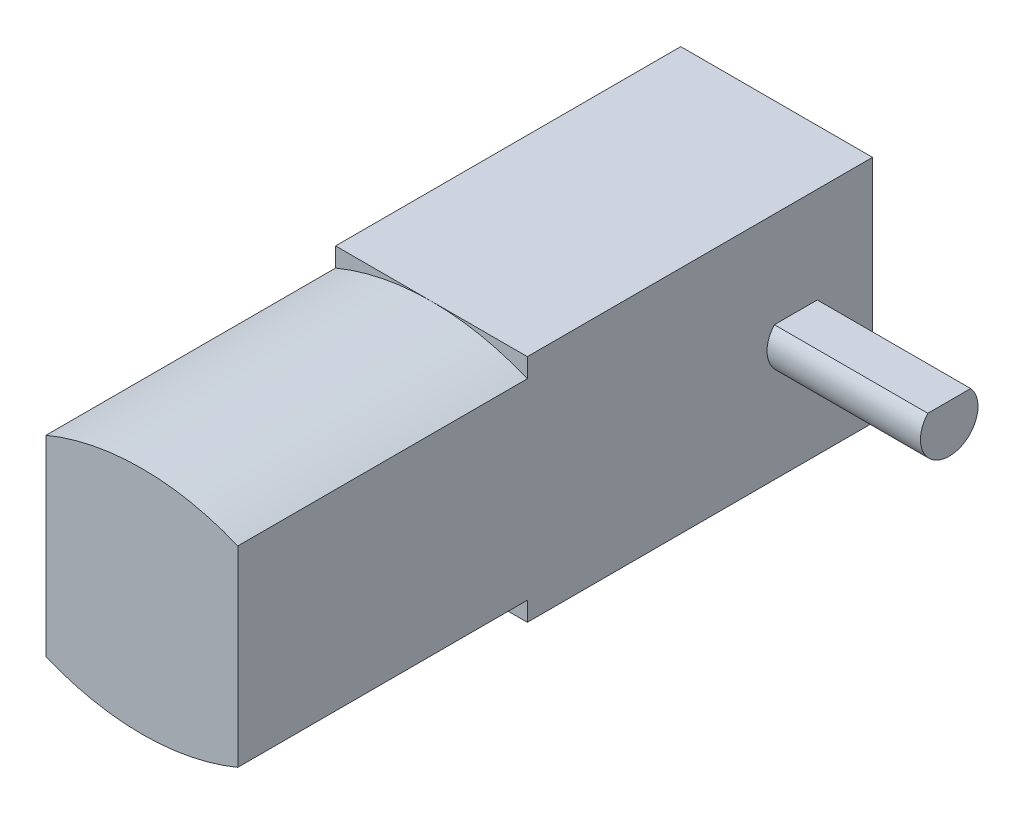
ISO-10303-21;
HEADER;
FILE_DESCRIPTION(('STEP AP214'),'2;1');
FILE_NAME('part.step','',(''),(''),'','','');
FILE_SCHEMA(('AUTOMOTIVE_DESIGN { 1 0 10303 214 1 1 1 1 }'));
ENDSEC;
DATA;
#1=APPLICATION_CONTEXT('core data for automotive mechanical design processes');
#2=APPLICATION_PROTOCOL_DEFINITION('international standard','automotive_design',2000,#1);
#3=PRODUCT_CONTEXT('',#1,'mechanical');
#4=PRODUCT('Part','Part','',(#3));
#5=PRODUCT_RELATED_PRODUCT_CATEGORY('part','',(#4));
#6=PRODUCT_DEFINITION_FORMATION('','',#4);
#7=PRODUCT_DEFINITION_CONTEXT('part definition',#1,'design');
#8=PRODUCT_DEFINITION('design','',#6,#7);
#9=PRODUCT_DEFINITION_SHAPE('','',#8);
#10=(LENGTH_UNIT() NAMED_UNIT(*) SI_UNIT(.MILLI.,.METRE.));
#11=(NAMED_UNIT(*) PLANE_ANGLE_UNIT() SI_UNIT($,.RADIAN.));
#12=(NAMED_UNIT(*) SI_UNIT($,.STERADIAN.) SOLID_ANGLE_UNIT());
#13=UNCERTAINTY_MEASURE_WITH_UNIT(LENGTH_MEASURE(1.E-05),#10,'distance_accuracy_value','');
#14=(GEOMETRIC_REPRESENTATION_CONTEXT(3) GLOBAL_UNCERTAINTY_ASSIGNED_CONTEXT((#13)) GLOBAL_UNIT_ASSIGNED_CONTEXT((#10,
#11,#12)) REPRESENTATION_CONTEXT('',''));
#15=CARTESIAN_POINT('',(0.,0.,0.));
#16=DIRECTION('',(0.,0.,1.));
#17=DIRECTION('',(1.,0.,0.));
#18=AXIS2_PLACEMENT_3D('',#15,#16,#17);
#19=CARTESIAN_POINT('',(5.,0.,15.1));
#20=DIRECTION('',(-1.,0.,0.));
#21=DIRECTION('',(0.,0.,1.));
#22=AXIS2_PLACEMENT_3D('',#19,#20,#21);
#23=PLANE('',#22);
#24=DIRECTION('',(0.,0.,1.));
#25=VECTOR('',#24,1.);
#26=CARTESIAN_POINT('',(5.,1.,0.));
#27=LINE('',#26,#25);
#28=CARTESIAN_POINT('',(5.,1.,-15.1180339887499));
#29=VERTEX_POINT('',#28);
#30=CARTESIAN_POINT('',(5.,1.,-12.8819660112501));
#31=VERTEX_POINT('',#30);
#32=EDGE_CURVE('E193',#29,#31,#27,.T.);
#33=ORIENTED_EDGE('',*,*,#32,.F.);
#34=CARTESIAN_POINT('',(5.,0.,-14.));
#35=DIRECTION('',(1.,0.,0.));
#36=DIRECTION('',(0.,0.,-1.));
#37=AXIS2_PLACEMENT_3D('',#34,#35,#36);
#38=CIRCLE('',#37,1.5);
#39=EDGE_CURVE('E52',#31,#29,#38,.T.);
#40=ORIENTED_EDGE('',*,*,#39,.F.);
#41=EDGE_LOOP('',(#33,#40));
#42=FACE_BOUND('',#41,.T.);
#43=DIRECTION('',(0.,0.,-1.));
#44=VECTOR('',#43,1.);
#45=CARTESIAN_POINT('',(5.,-5.,15.1));
#46=LINE('',#45,#44);
#47=CARTESIAN_POINT('',(5.,-5.,15.1));
#48=VERTEX_POINT('',#47);
#49=CARTESIAN_POINT('',(5.,-5.,0.));
#50=VERTEX_POINT('',#49);
#51=EDGE_CURVE('E61',#48,#50,#46,.T.);
#52=ORIENTED_EDGE('',*,*,#51,.T.);
#53=DIRECTION('',(0.,1.,0.));
#54=VECTOR('',#53,1.);
#55=CARTESIAN_POINT('',(5.,-6.,0.));
#56=LINE('',#55,#54);
#57=CARTESIAN_POINT('',(5.,-6.,0.));
#58=VERTEX_POINT('',#57);
#59=EDGE_CURVE('E142',#58,#50,#56,.T.);
#60=ORIENTED_EDGE('',*,*,#59,.F.);
#61=DIRECTION('',(0.,0.,1.));
#62=VECTOR('',#61,1.);
#63=CARTESIAN_POINT('',(5.,-6.,-18.));
#64=LINE('',#63,#62);
#65=CARTESIAN_POINT('',(5.,-6.,-18.));
#66=VERTEX_POINT('',#65);
#67=EDGE_CURVE('E158',#66,#58,#64,.T.);
#68=ORIENTED_EDGE('',*,*,#67,.F.);
#69=DIRECTION('',(0.,1.,0.));
#70=VECTOR('',#69,1.);
#71=CARTESIAN_POINT('',(5.,-6.,-18.));
#72=LINE('',#71,#70);
#73=CARTESIAN_POINT('',(5.,6.,-18.));
#74=VERTEX_POINT('',#73);
#75=EDGE_CURVE('E177',#66,#74,#72,.T.);
#76=ORIENTED_EDGE('',*,*,#75,.T.);
#77=DIRECTION('',(0.,0.,1.));
#78=VECTOR('',#77,1.);
#79=CARTESIAN_POINT('',(5.,6.,-18.));
#80=LINE('',#79,#78);
#81=CARTESIAN_POINT('',(5.,6.,0.));
#82=VERTEX_POINT('',#81);
#83=EDGE_CURVE('E161',#74,#82,#80,.T.);
#84=ORIENTED_EDGE('',*,*,#83,.T.);
#85=CARTESIAN_POINT('',(5.,5.,0.));
#86=VERTEX_POINT('',#85);
#87=EDGE_CURVE('E151',#86,#82,#56,.T.);
#88=ORIENTED_EDGE('',*,*,#87,.F.);
#89=DIRECTION('',(0.,0.,-1.));
#90=VECTOR('',#89,1.);
#91=CARTESIAN_POINT('',(5.,5.,15.1));
#92=LINE('',#91,#90);
#93=CARTESIAN_POINT('',(5.,5.,15.1));
#94=VERTEX_POINT('',#93);
#95=EDGE_CURVE('E11',#94,#86,#92,.T.);
#96=ORIENTED_EDGE('',*,*,#95,.F.);
#97=DIRECTION('',(0.,1.,0.));
#98=VECTOR('',#97,1.);
#99=CARTESIAN_POINT('',(5.,0.,15.1));
#100=LINE('',#99,#98);
#101=EDGE_CURVE('E97',#48,#94,#100,.T.);
#102=ORIENTED_EDGE('',*,*,#101,.F.);
#103=EDGE_LOOP('',(#52,#60,#68,#76,#84,#88,#96,#102));
#104=FACE_BOUND('',#103,.T.);
#105=ADVANCED_FACE('F39',(#42,#104),#23,.F.);
#106=CARTESIAN_POINT('',(0.,-7.0000000000001,15.1));
#107=DIRECTION('',(0.,0.,-1.));
#108=DIRECTION('',(-1.,0.,0.));
#109=AXIS2_PLACEMENT_3D('',#106,#107,#108);
#110=CYLINDRICAL_SURFACE('',#109,13.0000000000001);
#111=CARTESIAN_POINT('',(0.,-7.0000000000001,0.));
#112=DIRECTION('',(0.,0.,1.));
#113=DIRECTION('',(1.,0.,0.));
#114=AXIS2_PLACEMENT_3D('',#111,#112,#113);
#115=CIRCLE('',#114,13.0000000000001);
#116=CARTESIAN_POINT('',(0.,6.,0.));
#117=VERTEX_POINT('',#116);
#118=EDGE_CURVE('E114',#86,#117,#115,.T.);
#119=ORIENTED_EDGE('',*,*,#118,.T.);
#120=CARTESIAN_POINT('',(-5.,5.,0.));
#121=VERTEX_POINT('',#120);
#122=EDGE_CURVE('E81',#117,#121,#115,.T.);
#123=ORIENTED_EDGE('',*,*,#122,.T.);
#124=DIRECTION('',(0.,0.,-1.));
#125=VECTOR('',#124,1.);
#126=CARTESIAN_POINT('',(-5.,5.,15.1));
#127=LINE('',#126,#125);
#128=CARTESIAN_POINT('',(-5.,5.,15.1));
#129=VERTEX_POINT('',#128);
#130=EDGE_CURVE('E46',#129,#121,#127,.T.);
#131=ORIENTED_EDGE('',*,*,#130,.F.);
#132=CARTESIAN_POINT('',(0.,-7.0000000000001,15.1));
#133=DIRECTION('',(0.,0.,1.));
#134=DIRECTION('',(1.,0.,0.));
#135=AXIS2_PLACEMENT_3D('',#132,#133,#134);
#136=CIRCLE('',#135,13.0000000000001);
#137=EDGE_CURVE('E91',#94,#129,#136,.T.);
#138=ORIENTED_EDGE('',*,*,#137,.F.);
#139=ORIENTED_EDGE('',*,*,#95,.T.);
#140=EDGE_LOOP('',(#119,#123,#131,#138,#139));
#141=FACE_BOUND('',#140,.T.);
#142=ADVANCED_FACE('F103',(#141),#110,.T.);
#143=CARTESIAN_POINT('',(-5.,0.,15.1));
#144=DIRECTION('',(-1.,0.,0.));
#145=DIRECTION('',(0.,0.,1.));
#146=AXIS2_PLACEMENT_3D('',#143,#144,#145);
#147=PLANE('',#146);
#148=ORIENTED_EDGE('',*,*,#130,.T.);
#149=DIRECTION('',(0.,-1.,0.));
#150=VECTOR('',#149,1.);
#151=CARTESIAN_POINT('',(-5.,-6.,0.));
#152=LINE('',#151,#150);
#153=CARTESIAN_POINT('',(-5.,6.,0.));
#154=VERTEX_POINT('',#153);
#155=EDGE_CURVE('E75',#154,#121,#152,.T.);
#156=ORIENTED_EDGE('',*,*,#155,.F.);
#157=DIRECTION('',(0.,0.,1.));
#158=VECTOR('',#157,1.);
#159=CARTESIAN_POINT('',(-5.,6.,-18.));
#160=LINE('',#159,#158);
#161=CARTESIAN_POINT('',(-5.,6.,-18.));
#162=VERTEX_POINT('',#161);
#163=EDGE_CURVE('E164',#162,#154,#160,.T.);
#164=ORIENTED_EDGE('',*,*,#163,.F.);
#165=DIRECTION('',(0.,-1.,0.));
#166=VECTOR('',#165,1.);
#167=CARTESIAN_POINT('',(-5.,-6.,-18.));
#168=LINE('',#167,#166);
#169=CARTESIAN_POINT('',(-5.,-6.,-18.));
#170=VERTEX_POINT('',#169);
#171=EDGE_CURVE('E169',#162,#170,#168,.T.);
#172=ORIENTED_EDGE('',*,*,#171,.T.);
#173=DIRECTION('',(0.,0.,1.));
#174=VECTOR('',#173,1.);
#175=CARTESIAN_POINT('',(-5.,-6.,-18.));
#176=LINE('',#175,#174);
#177=CARTESIAN_POINT('',(-5.,-6.,0.));
#178=VERTEX_POINT('',#177);
#179=EDGE_CURVE('E155',#170,#178,#176,.T.);
#180=ORIENTED_EDGE('',*,*,#179,.T.);
#181=CARTESIAN_POINT('',(-5.,-5.,0.));
#182=VERTEX_POINT('',#181);
#183=EDGE_CURVE('E174',#182,#178,#152,.T.);
#184=ORIENTED_EDGE('',*,*,#183,.F.);
#185=DIRECTION('',(0.,0.,-1.));
#186=VECTOR('',#185,1.);
#187=CARTESIAN_POINT('',(-5.,-5.,15.1));
#188=LINE('',#187,#186);
#189=CARTESIAN_POINT('',(-5.,-5.,15.1));
#190=VERTEX_POINT('',#189);
#191=EDGE_CURVE('E105',#190,#182,#188,.T.);
#192=ORIENTED_EDGE('',*,*,#191,.F.);
#193=DIRECTION('',(0.,1.,0.));
#194=VECTOR('',#193,1.);
#195=CARTESIAN_POINT('',(-5.,0.,15.1));
#196=LINE('',#195,#194);
#197=EDGE_CURVE('E96',#190,#129,#196,.T.);
#198=ORIENTED_EDGE('',*,*,#197,.T.);
#199=EDGE_LOOP('',(#148,#156,#164,#172,#180,#184,#192,#198));
#200=FACE_BOUND('',#199,.T.);
#201=ADVANCED_FACE('F106',(#200),#147,.T.);
#202=CARTESIAN_POINT('',(0.,6.99999999999999,15.1));
#203=DIRECTION('',(0.,0.,-1.));
#204=DIRECTION('',(-1.,0.,0.));
#205=AXIS2_PLACEMENT_3D('',#202,#203,#204);
#206=CYLINDRICAL_SURFACE('',#205,13.);
#207=CARTESIAN_POINT('',(0.,6.99999999999999,0.));
#208=DIRECTION('',(0.,0.,1.));
#209=DIRECTION('',(1.,0.,0.));
#210=AXIS2_PLACEMENT_3D('',#207,#208,#209);
#211=CIRCLE('',#210,13.);
#212=CARTESIAN_POINT('',(0.,-6.,0.));
#213=VERTEX_POINT('',#212);
#214=EDGE_CURVE('E117',#50,#213,#211,.F.);
#215=ORIENTED_EDGE('',*,*,#214,.F.);
#216=ORIENTED_EDGE('',*,*,#51,.F.);
#217=CARTESIAN_POINT('',(0.,6.99999999999999,15.1));
#218=DIRECTION('',(0.,0.,1.));
#219=DIRECTION('',(1.,0.,0.));
#220=AXIS2_PLACEMENT_3D('',#217,#218,#219);
#221=CIRCLE('',#220,13.);
#222=EDGE_CURVE('E109',#48,#190,#221,.F.);
#223=ORIENTED_EDGE('',*,*,#222,.T.);
#224=ORIENTED_EDGE('',*,*,#191,.T.);
#225=EDGE_CURVE('E116',#213,#182,#211,.F.);
#226=ORIENTED_EDGE('',*,*,#225,.F.);
#227=EDGE_LOOP('',(#215,#216,#223,#224,#226));
#228=FACE_BOUND('',#227,.T.);
#229=ADVANCED_FACE('F123',(#228),#206,.T.);
#230=CARTESIAN_POINT('',(0.,0.,15.1));
#231=DIRECTION('',(0.,0.,1.));
#232=DIRECTION('',(1.,0.,0.));
#233=AXIS2_PLACEMENT_3D('',#230,#231,#232);
#234=PLANE('',#233);
#235=ORIENTED_EDGE('',*,*,#101,.T.);
#236=ORIENTED_EDGE('',*,*,#137,.T.);
#237=ORIENTED_EDGE('',*,*,#197,.F.);
#238=ORIENTED_EDGE('',*,*,#222,.F.);
#239=EDGE_LOOP('',(#235,#236,#237,#238));
#240=FACE_BOUND('',#239,.T.);
#241=ADVANCED_FACE('F93',(#240),#234,.T.);
#242=CARTESIAN_POINT('',(0.,0.,0.));
#243=DIRECTION('',(0.,0.,1.));
#244=DIRECTION('',(1.,0.,0.));
#245=AXIS2_PLACEMENT_3D('',#242,#243,#244);
#246=PLANE('',#245);
#247=ORIENTED_EDGE('',*,*,#59,.T.);
#248=ORIENTED_EDGE('',*,*,#214,.T.);
#249=DIRECTION('',(1.,0.,0.));
#250=VECTOR('',#249,1.);
#251=CARTESIAN_POINT('',(5.,-6.,0.));
#252=LINE('',#251,#250);
#253=EDGE_CURVE('E146',#213,#58,#252,.T.);
#254=ORIENTED_EDGE('',*,*,#253,.T.);
#255=EDGE_LOOP('',(#247,#248,#254));
#256=FACE_BOUND('',#255,.T.);
#257=ADVANCED_FACE('F143',(#256),#246,.T.);
#258=ORIENTED_EDGE('',*,*,#118,.F.);
#259=ORIENTED_EDGE('',*,*,#87,.T.);
#260=DIRECTION('',(-1.,0.,0.));
#261=VECTOR('',#260,1.);
#262=CARTESIAN_POINT('',(5.,6.,0.));
#263=LINE('',#262,#261);
#264=EDGE_CURVE('E167',#82,#117,#263,.T.);
#265=ORIENTED_EDGE('',*,*,#264,.T.);
#266=EDGE_LOOP('',(#258,#259,#265));
#267=FACE_BOUND('',#266,.T.);
#268=ADVANCED_FACE('F252',(#267),#246,.T.);
#269=ORIENTED_EDGE('',*,*,#122,.F.);
#270=EDGE_CURVE('E150',#117,#154,#263,.T.);
#271=ORIENTED_EDGE('',*,*,#270,.T.);
#272=ORIENTED_EDGE('',*,*,#155,.T.);
#273=EDGE_LOOP('',(#269,#271,#272));
#274=FACE_BOUND('',#273,.T.);
#275=ADVANCED_FACE('F228',(#274),#246,.T.);
#276=CARTESIAN_POINT('',(5.,6.,-18.));
#277=DIRECTION('',(0.,1.,0.));
#278=DIRECTION('',(-1.,0.,0.));
#279=AXIS2_PLACEMENT_3D('',#276,#277,#278);
#280=PLANE('',#279);
#281=ORIENTED_EDGE('',*,*,#264,.F.);
#282=ORIENTED_EDGE('',*,*,#83,.F.);
#283=DIRECTION('',(-1.,0.,0.));
#284=VECTOR('',#283,1.);
#285=CARTESIAN_POINT('',(5.,6.,-18.));
#286=LINE('',#285,#284);
#287=EDGE_CURVE('E159',#74,#162,#286,.T.);
#288=ORIENTED_EDGE('',*,*,#287,.T.);
#289=ORIENTED_EDGE('',*,*,#163,.T.);
#290=ORIENTED_EDGE('',*,*,#270,.F.);
#291=EDGE_LOOP('',(#281,#282,#288,#289,#290));
#292=FACE_BOUND('',#291,.T.);
#293=ADVANCED_FACE('F231',(#292),#280,.T.);
#294=CARTESIAN_POINT('',(5.,-6.,-18.));
#295=DIRECTION('',(0.,-1.,0.));
#296=DIRECTION('',(1.,0.,0.));
#297=AXIS2_PLACEMENT_3D('',#294,#295,#296);
#298=PLANE('',#297);
#299=EDGE_CURVE('E171',#178,#213,#252,.T.);
#300=ORIENTED_EDGE('',*,*,#299,.F.);
#301=ORIENTED_EDGE('',*,*,#179,.F.);
#302=DIRECTION('',(1.,0.,0.));
#303=VECTOR('',#302,1.);
#304=CARTESIAN_POINT('',(5.,-6.,-18.));
#305=LINE('',#304,#303);
#306=EDGE_CURVE('E180',#170,#66,#305,.T.);
#307=ORIENTED_EDGE('',*,*,#306,.T.);
#308=ORIENTED_EDGE('',*,*,#67,.T.);
#309=ORIENTED_EDGE('',*,*,#253,.F.);
#310=EDGE_LOOP('',(#300,#301,#307,#308,#309));
#311=FACE_BOUND('',#310,.T.);
#312=ADVANCED_FACE('F240',(#311),#298,.T.);
#313=CARTESIAN_POINT('',(0.,0.,-18.));
#314=DIRECTION('',(0.,0.,1.));
#315=DIRECTION('',(1.,0.,0.));
#316=AXIS2_PLACEMENT_3D('',#313,#314,#315);
#317=PLANE('',#316);
#318=ORIENTED_EDGE('',*,*,#171,.F.);
#319=ORIENTED_EDGE('',*,*,#287,.F.);
#320=ORIENTED_EDGE('',*,*,#75,.F.);
#321=ORIENTED_EDGE('',*,*,#306,.F.);
#322=EDGE_LOOP('',(#318,#319,#320,#321));
#323=FACE_BOUND('',#322,.T.);
#324=ADVANCED_FACE('F236',(#323),#317,.F.);
#325=ORIENTED_EDGE('',*,*,#299,.T.);
#326=ORIENTED_EDGE('',*,*,#225,.T.);
#327=ORIENTED_EDGE('',*,*,#183,.T.);
#328=EDGE_LOOP('',(#325,#326,#327));
#329=FACE_BOUND('',#328,.T.);
#330=ADVANCED_FACE('F241',(#329),#246,.T.);
#331=CARTESIAN_POINT('',(13.,1.,0.));
#332=DIRECTION('',(0.,-1.,0.));
#333=DIRECTION('',(0.,0.,-1.));
#334=AXIS2_PLACEMENT_3D('',#331,#332,#333);
#335=PLANE('',#334);
#336=ORIENTED_EDGE('',*,*,#32,.T.);
#337=DIRECTION('',(-1.,0.,0.));
#338=VECTOR('',#337,1.);
#339=CARTESIAN_POINT('',(13.,1.,-12.8819660112501));
#340=LINE('',#339,#338);
#341=CARTESIAN_POINT('',(13.,1.,-12.8819660112501));
#342=VERTEX_POINT('',#341);
#343=EDGE_CURVE('E185',#342,#31,#340,.T.);
#344=ORIENTED_EDGE('',*,*,#343,.F.);
#345=DIRECTION('',(0.,0.,1.));
#346=VECTOR('',#345,1.);
#347=CARTESIAN_POINT('',(13.,1.,0.));
#348=LINE('',#347,#346);
#349=CARTESIAN_POINT('',(13.,1.,-15.1180339887499));
#350=VERTEX_POINT('',#349);
#351=EDGE_CURVE('E192',#350,#342,#348,.T.);
#352=ORIENTED_EDGE('',*,*,#351,.F.);
#353=DIRECTION('',(-1.,0.,0.));
#354=VECTOR('',#353,1.);
#355=CARTESIAN_POINT('',(13.,1.,-15.1180339887499));
#356=LINE('',#355,#354);
#357=EDGE_CURVE('E187',#350,#29,#356,.T.);
#358=ORIENTED_EDGE('',*,*,#357,.T.);
#359=EDGE_LOOP('',(#336,#344,#352,#358));
#360=FACE_BOUND('',#359,.T.);
#361=ADVANCED_FACE('F210',(#360),#335,.F.);
#362=CARTESIAN_POINT('',(13.,0.,-14.));
#363=DIRECTION('',(-1.,0.,0.));
#364=DIRECTION('',(0.,0.,1.));
#365=AXIS2_PLACEMENT_3D('',#362,#363,#364);
#366=CYLINDRICAL_SURFACE('',#365,1.5);
#367=ORIENTED_EDGE('',*,*,#39,.T.);
#368=ORIENTED_EDGE('',*,*,#357,.F.);
#369=CARTESIAN_POINT('',(13.,0.,-14.));
#370=DIRECTION('',(1.,0.,0.));
#371=DIRECTION('',(0.,0.,-1.));
#372=AXIS2_PLACEMENT_3D('',#369,#370,#371);
#373=CIRCLE('',#372,1.5);
#374=EDGE_CURVE('E190',#342,#350,#373,.T.);
#375=ORIENTED_EDGE('',*,*,#374,.F.);
#376=ORIENTED_EDGE('',*,*,#343,.T.);
#377=EDGE_LOOP('',(#367,#368,#375,#376));
#378=FACE_BOUND('',#377,.T.);
#379=ADVANCED_FACE('F212',(#378),#366,.T.);
#380=CARTESIAN_POINT('',(13.,0.,0.));
#381=DIRECTION('',(1.,0.,0.));
#382=DIRECTION('',(0.,0.,-1.));
#383=AXIS2_PLACEMENT_3D('',#380,#381,#382);
#384=PLANE('',#383);
#385=ORIENTED_EDGE('',*,*,#351,.T.);
#386=ORIENTED_EDGE('',*,*,#374,.T.);
#387=EDGE_LOOP('',(#385,#386));
#388=FACE_BOUND('',#387,.T.);
#389=ADVANCED_FACE('F203',(#388),#384,.T.);
#390=CLOSED_SHELL('',(#105,#142,#201,#229,#241,#257,#268,#275,#293,#312,#324,#330,#361,#379,#389));
#391=MANIFOLD_SOLID_BREP('B2',#390);
#392=ADVANCED_BREP_SHAPE_REPRESENTATION('',(#18,#391),#14);
#393=SHAPE_DEFINITION_REPRESENTATION(#9,#392);
ENDSEC;
END-ISO-10303-21;
